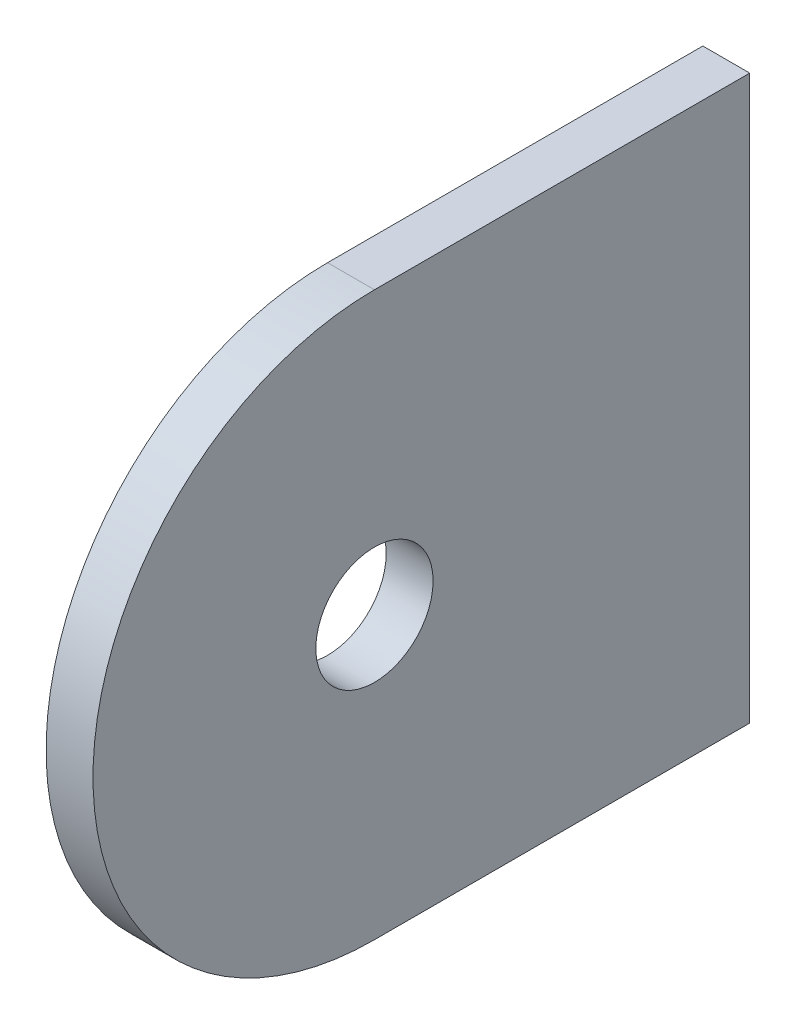
ISO-10303-21;
HEADER;
FILE_DESCRIPTION(('STEP AP214'),'2;1');
FILE_NAME('part.step','',(''),(''),'','','');
FILE_SCHEMA(('AUTOMOTIVE_DESIGN { 1 0 10303 214 1 1 1 1 }'));
ENDSEC;
DATA;
#1=APPLICATION_CONTEXT('core data for automotive mechanical design processes');
#2=APPLICATION_PROTOCOL_DEFINITION('international standard','automotive_design',2000,#1);
#3=PRODUCT_CONTEXT('',#1,'mechanical');
#4=PRODUCT('Part','Part','',(#3));
#5=PRODUCT_RELATED_PRODUCT_CATEGORY('part','',(#4));
#6=PRODUCT_DEFINITION_FORMATION('','',#4);
#7=PRODUCT_DEFINITION_CONTEXT('part definition',#1,'design');
#8=PRODUCT_DEFINITION('design','',#6,#7);
#9=PRODUCT_DEFINITION_SHAPE('','',#8);
#10=(LENGTH_UNIT() NAMED_UNIT(*) SI_UNIT(.MILLI.,.METRE.));
#11=(NAMED_UNIT(*) PLANE_ANGLE_UNIT() SI_UNIT($,.RADIAN.));
#12=(NAMED_UNIT(*) SI_UNIT($,.STERADIAN.) SOLID_ANGLE_UNIT());
#13=UNCERTAINTY_MEASURE_WITH_UNIT(LENGTH_MEASURE(1.E-05),#10,'distance_accuracy_value','');
#14=(GEOMETRIC_REPRESENTATION_CONTEXT(3) GLOBAL_UNCERTAINTY_ASSIGNED_CONTEXT((#13)) GLOBAL_UNIT_ASSIGNED_CONTEXT((#10,
#11,#12)) REPRESENTATION_CONTEXT('',''));
#15=CARTESIAN_POINT('',(0.,0.,0.));
#16=DIRECTION('',(0.,0.,1.));
#17=DIRECTION('',(1.,0.,0.));
#18=AXIS2_PLACEMENT_3D('',#15,#16,#17);
#19=CARTESIAN_POINT('',(1.5875,0.,25.4));
#20=DIRECTION('',(1.,0.,0.));
#21=DIRECTION('',(0.,0.,-1.));
#22=AXIS2_PLACEMENT_3D('',#19,#20,#21);
#23=PLANE('',#22);
#24=DIRECTION('',(0.,1.,0.));
#25=VECTOR('',#24,1.);
#26=CARTESIAN_POINT('',(1.5875,-19.05,0.));
#27=LINE('',#26,#25);
#28=CARTESIAN_POINT('',(1.5875,-19.05,0.));
#29=VERTEX_POINT('',#28);
#30=CARTESIAN_POINT('',(1.5875,19.05,0.));
#31=VERTEX_POINT('',#30);
#32=EDGE_CURVE('E84',#29,#31,#27,.T.);
#33=ORIENTED_EDGE('',*,*,#32,.T.);
#34=DIRECTION('',(0.,0.,1.));
#35=VECTOR('',#34,1.);
#36=CARTESIAN_POINT('',(1.5875,19.05,25.4));
#37=LINE('',#36,#35);
#38=CARTESIAN_POINT('',(1.5875,19.05,25.4));
#39=VERTEX_POINT('',#38);
#40=EDGE_CURVE('E79',#31,#39,#37,.T.);
#41=ORIENTED_EDGE('',*,*,#40,.T.);
#42=CARTESIAN_POINT('',(1.5875,0.,25.4));
#43=DIRECTION('',(1.,0.,0.));
#44=DIRECTION('',(0.,0.,-1.));
#45=AXIS2_PLACEMENT_3D('',#42,#43,#44);
#46=CIRCLE('',#45,19.05);
#47=CARTESIAN_POINT('',(1.5875,-19.05,25.4));
#48=VERTEX_POINT('',#47);
#49=EDGE_CURVE('E82',#39,#48,#46,.T.);
#50=ORIENTED_EDGE('',*,*,#49,.T.);
#51=DIRECTION('',(0.,0.,-1.));
#52=VECTOR('',#51,1.);
#53=CARTESIAN_POINT('',(1.5875,-19.05,25.4));
#54=LINE('',#53,#52);
#55=EDGE_CURVE('E49',#48,#29,#54,.T.);
#56=ORIENTED_EDGE('',*,*,#55,.T.);
#57=EDGE_LOOP('',(#33,#41,#50,#56));
#58=FACE_BOUND('',#57,.T.);
#59=CARTESIAN_POINT('',(1.5875,0.,25.4));
#60=DIRECTION('',(1.,0.,0.));
#61=DIRECTION('',(0.,0.,-1.));
#62=AXIS2_PLACEMENT_3D('',#59,#60,#61);
#63=CIRCLE('',#62,3.96875);
#64=CARTESIAN_POINT('',(1.5875,0.,21.43125));
#65=VERTEX_POINT('',#64);
#66=EDGE_CURVE('E99',#65,#65,#63,.T.);
#67=ORIENTED_EDGE('',*,*,#66,.F.);
#68=EDGE_LOOP('',(#67));
#69=FACE_BOUND('',#68,.T.);
#70=ADVANCED_FACE('F32',(#58,#69),#23,.T.);
#71=CARTESIAN_POINT('',(-1.5875,0.,25.4));
#72=DIRECTION('',(1.,0.,0.));
#73=DIRECTION('',(0.,0.,-1.));
#74=AXIS2_PLACEMENT_3D('',#71,#72,#73);
#75=PLANE('',#74);
#76=DIRECTION('',(0.,1.,0.));
#77=VECTOR('',#76,1.);
#78=CARTESIAN_POINT('',(-1.5875,-19.05,0.));
#79=LINE('',#78,#77);
#80=CARTESIAN_POINT('',(-1.5875,-19.05,0.));
#81=VERTEX_POINT('',#80);
#82=CARTESIAN_POINT('',(-1.5875,19.05,0.));
#83=VERTEX_POINT('',#82);
#84=EDGE_CURVE('E96',#81,#83,#79,.T.);
#85=ORIENTED_EDGE('',*,*,#84,.F.);
#86=DIRECTION('',(0.,0.,-1.));
#87=VECTOR('',#86,1.);
#88=CARTESIAN_POINT('',(-1.5875,-19.05,25.4));
#89=LINE('',#88,#87);
#90=CARTESIAN_POINT('',(-1.5875,-19.05,25.4));
#91=VERTEX_POINT('',#90);
#92=EDGE_CURVE('E72',#91,#81,#89,.T.);
#93=ORIENTED_EDGE('',*,*,#92,.F.);
#94=CARTESIAN_POINT('',(-1.5875,0.,25.4));
#95=DIRECTION('',(1.,0.,0.));
#96=DIRECTION('',(0.,0.,-1.));
#97=AXIS2_PLACEMENT_3D('',#94,#95,#96);
#98=CIRCLE('',#97,19.05);
#99=CARTESIAN_POINT('',(-1.5875,19.05,25.4));
#100=VERTEX_POINT('',#99);
#101=EDGE_CURVE('E66',#100,#91,#98,.T.);
#102=ORIENTED_EDGE('',*,*,#101,.F.);
#103=DIRECTION('',(0.,0.,1.));
#104=VECTOR('',#103,1.);
#105=CARTESIAN_POINT('',(-1.5875,19.05,25.4));
#106=LINE('',#105,#104);
#107=EDGE_CURVE('E88',#83,#100,#106,.T.);
#108=ORIENTED_EDGE('',*,*,#107,.F.);
#109=EDGE_LOOP('',(#85,#93,#102,#108));
#110=FACE_BOUND('',#109,.T.);
#111=CARTESIAN_POINT('',(-1.5875,0.,25.4));
#112=DIRECTION('',(1.,0.,0.));
#113=DIRECTION('',(0.,0.,-1.));
#114=AXIS2_PLACEMENT_3D('',#111,#112,#113);
#115=CIRCLE('',#114,3.96875);
#116=CARTESIAN_POINT('',(-1.5875,0.,21.43125));
#117=VERTEX_POINT('',#116);
#118=EDGE_CURVE('E111',#117,#117,#115,.T.);
#119=ORIENTED_EDGE('',*,*,#118,.T.);
#120=EDGE_LOOP('',(#119));
#121=FACE_BOUND('',#120,.T.);
#122=ADVANCED_FACE('F107',(#110,#121),#75,.F.);
#123=CARTESIAN_POINT('',(1.5875,-19.05,0.));
#124=DIRECTION('',(0.,0.,1.));
#125=DIRECTION('',(0.,-1.,0.));
#126=AXIS2_PLACEMENT_3D('',#123,#124,#125);
#127=PLANE('',#126);
#128=ORIENTED_EDGE('',*,*,#84,.T.);
#129=DIRECTION('',(-1.,0.,0.));
#130=VECTOR('',#129,1.);
#131=CARTESIAN_POINT('',(1.5875,19.05,0.));
#132=LINE('',#131,#130);
#133=EDGE_CURVE('E11',#31,#83,#132,.T.);
#134=ORIENTED_EDGE('',*,*,#133,.F.);
#135=ORIENTED_EDGE('',*,*,#32,.F.);
#136=DIRECTION('',(-1.,0.,0.));
#137=VECTOR('',#136,1.);
#138=CARTESIAN_POINT('',(1.5875,-19.05,0.));
#139=LINE('',#138,#137);
#140=EDGE_CURVE('E92',#29,#81,#139,.T.);
#141=ORIENTED_EDGE('',*,*,#140,.T.);
#142=EDGE_LOOP('',(#128,#134,#135,#141));
#143=FACE_BOUND('',#142,.T.);
#144=ADVANCED_FACE('F34',(#143),#127,.F.);
#145=CARTESIAN_POINT('',(1.5875,19.05,25.4));
#146=DIRECTION('',(0.,-1.,0.));
#147=DIRECTION('',(0.,0.,-1.));
#148=AXIS2_PLACEMENT_3D('',#145,#146,#147);
#149=PLANE('',#148);
#150=ORIENTED_EDGE('',*,*,#107,.T.);
#151=DIRECTION('',(-1.,0.,0.));
#152=VECTOR('',#151,1.);
#153=CARTESIAN_POINT('',(1.5875,19.05,25.4));
#154=LINE('',#153,#152);
#155=EDGE_CURVE('E41',#39,#100,#154,.T.);
#156=ORIENTED_EDGE('',*,*,#155,.F.);
#157=ORIENTED_EDGE('',*,*,#40,.F.);
#158=ORIENTED_EDGE('',*,*,#133,.T.);
#159=EDGE_LOOP('',(#150,#156,#157,#158));
#160=FACE_BOUND('',#159,.T.);
#161=ADVANCED_FACE('F87',(#160),#149,.F.);
#162=CARTESIAN_POINT('',(1.5875,0.,25.4));
#163=DIRECTION('',(-1.,0.,0.));
#164=DIRECTION('',(0.,0.,1.));
#165=AXIS2_PLACEMENT_3D('',#162,#163,#164);
#166=CYLINDRICAL_SURFACE('',#165,19.05);
#167=ORIENTED_EDGE('',*,*,#101,.T.);
#168=DIRECTION('',(-1.,0.,0.));
#169=VECTOR('',#168,1.);
#170=CARTESIAN_POINT('',(1.5875,-19.05,25.4));
#171=LINE('',#170,#169);
#172=EDGE_CURVE('E89',#48,#91,#171,.T.);
#173=ORIENTED_EDGE('',*,*,#172,.F.);
#174=ORIENTED_EDGE('',*,*,#49,.F.);
#175=ORIENTED_EDGE('',*,*,#155,.T.);
#176=EDGE_LOOP('',(#167,#173,#174,#175));
#177=FACE_BOUND('',#176,.T.);
#178=ADVANCED_FACE('F90',(#177),#166,.T.);
#179=CARTESIAN_POINT('',(1.5875,-19.05,25.4));
#180=DIRECTION('',(0.,1.,0.));
#181=DIRECTION('',(0.,0.,1.));
#182=AXIS2_PLACEMENT_3D('',#179,#180,#181);
#183=PLANE('',#182);
#184=ORIENTED_EDGE('',*,*,#92,.T.);
#185=ORIENTED_EDGE('',*,*,#140,.F.);
#186=ORIENTED_EDGE('',*,*,#55,.F.);
#187=ORIENTED_EDGE('',*,*,#172,.T.);
#188=EDGE_LOOP('',(#184,#185,#186,#187));
#189=FACE_BOUND('',#188,.T.);
#190=ADVANCED_FACE('F104',(#189),#183,.F.);
#191=CARTESIAN_POINT('',(1.5875,0.,25.4));
#192=DIRECTION('',(-1.,0.,0.));
#193=DIRECTION('',(0.,0.,1.));
#194=AXIS2_PLACEMENT_3D('',#191,#192,#193);
#195=CYLINDRICAL_SURFACE('',#194,3.96875);
#196=ORIENTED_EDGE('',*,*,#66,.T.);
#197=EDGE_LOOP('',(#196));
#198=FACE_BOUND('',#197,.T.);
#199=ORIENTED_EDGE('',*,*,#118,.F.);
#200=EDGE_LOOP('',(#199));
#201=FACE_BOUND('',#200,.T.);
#202=ADVANCED_FACE('F117',(#198,#201),#195,.F.);
#203=CLOSED_SHELL('',(#70,#122,#144,#161,#178,#190,#202));
#204=MANIFOLD_SOLID_BREP('B2',#203);
#205=ADVANCED_BREP_SHAPE_REPRESENTATION('',(#18,#204),#14);
#206=SHAPE_DEFINITION_REPRESENTATION(#9,#205);
ENDSEC;
END-ISO-10303-21;
